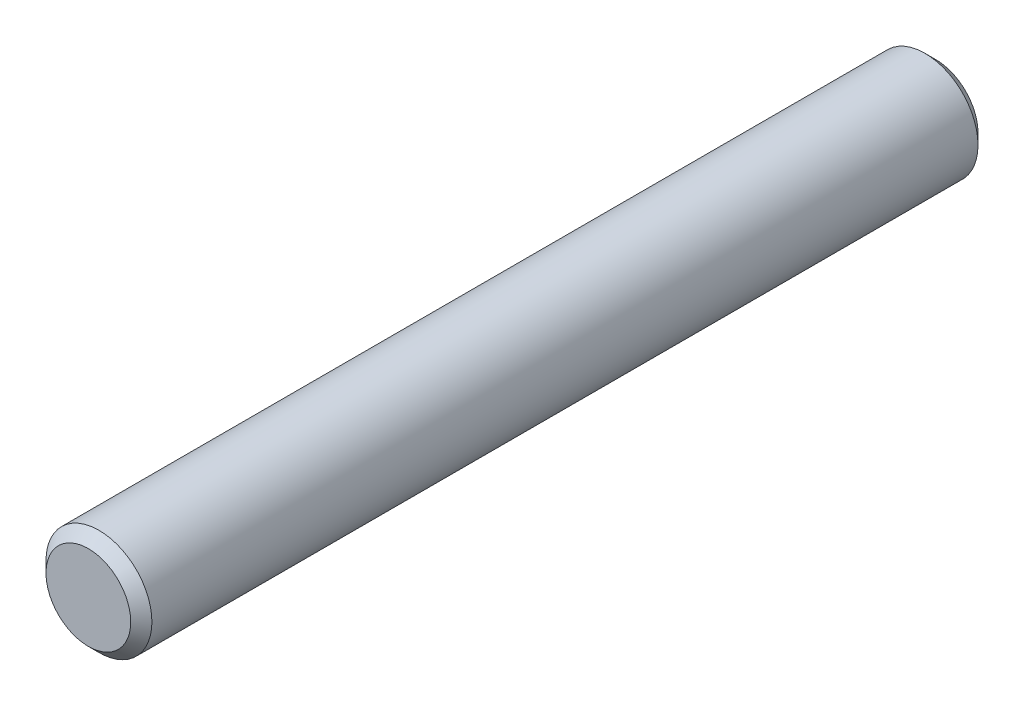
ISO-10303-21;
HEADER;
FILE_DESCRIPTION(('STEP AP214'),'2;1');
FILE_NAME('part.step','',(''),(''),'','','');
FILE_SCHEMA(('AUTOMOTIVE_DESIGN { 1 0 10303 214 1 1 1 1 }'));
ENDSEC;
DATA;
#1=APPLICATION_CONTEXT('core data for automotive mechanical design processes');
#2=APPLICATION_PROTOCOL_DEFINITION('international standard','automotive_design',2000,#1);
#3=PRODUCT_CONTEXT('',#1,'mechanical');
#4=PRODUCT('Part','Part','',(#3));
#5=PRODUCT_RELATED_PRODUCT_CATEGORY('part','',(#4));
#6=PRODUCT_DEFINITION_FORMATION('','',#4);
#7=PRODUCT_DEFINITION_CONTEXT('part definition',#1,'design');
#8=PRODUCT_DEFINITION('design','',#6,#7);
#9=PRODUCT_DEFINITION_SHAPE('','',#8);
#10=(LENGTH_UNIT() NAMED_UNIT(*) SI_UNIT(.MILLI.,.METRE.));
#11=(NAMED_UNIT(*) PLANE_ANGLE_UNIT() SI_UNIT($,.RADIAN.));
#12=(NAMED_UNIT(*) SI_UNIT($,.STERADIAN.) SOLID_ANGLE_UNIT());
#13=UNCERTAINTY_MEASURE_WITH_UNIT(LENGTH_MEASURE(1.E-05),#10,'distance_accuracy_value','');
#14=(GEOMETRIC_REPRESENTATION_CONTEXT(3) GLOBAL_UNCERTAINTY_ASSIGNED_CONTEXT((#13)) GLOBAL_UNIT_ASSIGNED_CONTEXT((#10,
#11,#12)) REPRESENTATION_CONTEXT('',''));
#15=CARTESIAN_POINT('',(0.,0.,0.));
#16=DIRECTION('',(0.,0.,1.));
#17=DIRECTION('',(1.,0.,0.));
#18=AXIS2_PLACEMENT_3D('',#15,#16,#17);
#19=CARTESIAN_POINT('',(0.,0.,-11.6999999999519));
#20=DIRECTION('',(0.,0.,1.));
#21=DIRECTION('',(1.,0.,0.));
#22=AXIS2_PLACEMENT_3D('',#19,#20,#21);
#23=CONICAL_SURFACE('',#22,1.49999999999173,0.785398163397449);
#24=CARTESIAN_POINT('',(0.,0.,-11.9999999999038));
#25=DIRECTION('',(0.,0.,1.));
#26=DIRECTION('',(1.,0.,0.));
#27=AXIS2_PLACEMENT_3D('',#24,#25,#26);
#28=CIRCLE('',#27,1.20000000003984);
#29=CARTESIAN_POINT('',(1.20000000003984,0.,-11.9999999999038));
#30=VERTEX_POINT('',#29);
#31=EDGE_CURVE('E54',#30,#30,#28,.T.);
#32=ORIENTED_EDGE('',*,*,#31,.T.);
#33=EDGE_LOOP('',(#32));
#34=FACE_BOUND('',#33,.T.);
#35=CARTESIAN_POINT('',(0.,0.,-11.6999999999519));
#36=DIRECTION('',(0.,0.,1.));
#37=DIRECTION('',(1.,0.,0.));
#38=AXIS2_PLACEMENT_3D('',#35,#36,#37);
#39=CIRCLE('',#38,1.49999999999173);
#40=CARTESIAN_POINT('',(1.49999999999172,0.,-11.6999999999519));
#41=VERTEX_POINT('',#40);
#42=EDGE_CURVE('E12',#41,#41,#39,.T.);
#43=ORIENTED_EDGE('',*,*,#42,.F.);
#44=EDGE_LOOP('',(#43));
#45=FACE_BOUND('',#44,.T.);
#46=ADVANCED_FACE('F40',(#34,#45),#23,.T.);
#47=CARTESIAN_POINT('',(0.,0.,-11.9999999999038));
#48=DIRECTION('',(0.,0.,1.));
#49=DIRECTION('',(1.,0.,0.));
#50=AXIS2_PLACEMENT_3D('',#47,#48,#49);
#51=CYLINDRICAL_SURFACE('',#50,1.49999999999173);
#52=ORIENTED_EDGE('',*,*,#42,.T.);
#53=EDGE_LOOP('',(#52));
#54=FACE_BOUND('',#53,.T.);
#55=CARTESIAN_POINT('',(0.,0.,11.7000000000481));
#56=DIRECTION('',(0.,0.,1.));
#57=DIRECTION('',(1.,0.,0.));
#58=AXIS2_PLACEMENT_3D('',#55,#56,#57);
#59=CIRCLE('',#58,1.49999999999172);
#60=CARTESIAN_POINT('',(1.49999999999172,0.,11.7000000000481));
#61=VERTEX_POINT('',#60);
#62=EDGE_CURVE('E46',#61,#61,#59,.T.);
#63=ORIENTED_EDGE('',*,*,#62,.F.);
#64=EDGE_LOOP('',(#63));
#65=FACE_BOUND('',#64,.T.);
#66=ADVANCED_FACE('F73',(#54,#65),#51,.T.);
#67=CARTESIAN_POINT('',(0.,0.,12.));
#68=DIRECTION('',(0.,0.,-1.));
#69=DIRECTION('',(-1.,0.,0.));
#70=AXIS2_PLACEMENT_3D('',#67,#68,#69);
#71=CONICAL_SURFACE('',#70,1.20000000003984,0.785398163397444);
#72=ORIENTED_EDGE('',*,*,#62,.T.);
#73=EDGE_LOOP('',(#72));
#74=FACE_BOUND('',#73,.T.);
#75=CARTESIAN_POINT('',(0.,0.,12.));
#76=DIRECTION('',(0.,0.,1.));
#77=DIRECTION('',(1.,0.,0.));
#78=AXIS2_PLACEMENT_3D('',#75,#76,#77);
#79=CIRCLE('',#78,1.20000000003984);
#80=CARTESIAN_POINT('',(1.20000000003984,0.,12.));
#81=VERTEX_POINT('',#80);
#82=EDGE_CURVE('E50',#81,#81,#79,.T.);
#83=ORIENTED_EDGE('',*,*,#82,.F.);
#84=EDGE_LOOP('',(#83));
#85=FACE_BOUND('',#84,.T.);
#86=ADVANCED_FACE('F69',(#74,#85),#71,.T.);
#87=CARTESIAN_POINT('',(0.,0.,12.));
#88=DIRECTION('',(0.,0.,1.));
#89=DIRECTION('',(1.,0.,0.));
#90=AXIS2_PLACEMENT_3D('',#87,#88,#89);
#91=PLANE('',#90);
#92=ORIENTED_EDGE('',*,*,#82,.T.);
#93=EDGE_LOOP('',(#92));
#94=FACE_BOUND('',#93,.T.);
#95=ADVANCED_FACE('F64',(#94),#91,.T.);
#96=CARTESIAN_POINT('',(1.20000000003984,0.,-11.9999999999038));
#97=DIRECTION('',(0.,0.,-1.));
#98=DIRECTION('',(-1.,0.,0.));
#99=AXIS2_PLACEMENT_3D('',#96,#97,#98);
#100=PLANE('',#99);
#101=ORIENTED_EDGE('',*,*,#31,.F.);
#102=EDGE_LOOP('',(#101));
#103=FACE_BOUND('',#102,.T.);
#104=ADVANCED_FACE('F62',(#103),#100,.T.);
#105=CLOSED_SHELL('',(#46,#66,#86,#95,#104));
#106=MANIFOLD_SOLID_BREP('B2',#105);
#107=ADVANCED_BREP_SHAPE_REPRESENTATION('',(#18,#106),#14);
#108=SHAPE_DEFINITION_REPRESENTATION(#9,#107);
ENDSEC;
END-ISO-10303-21;
